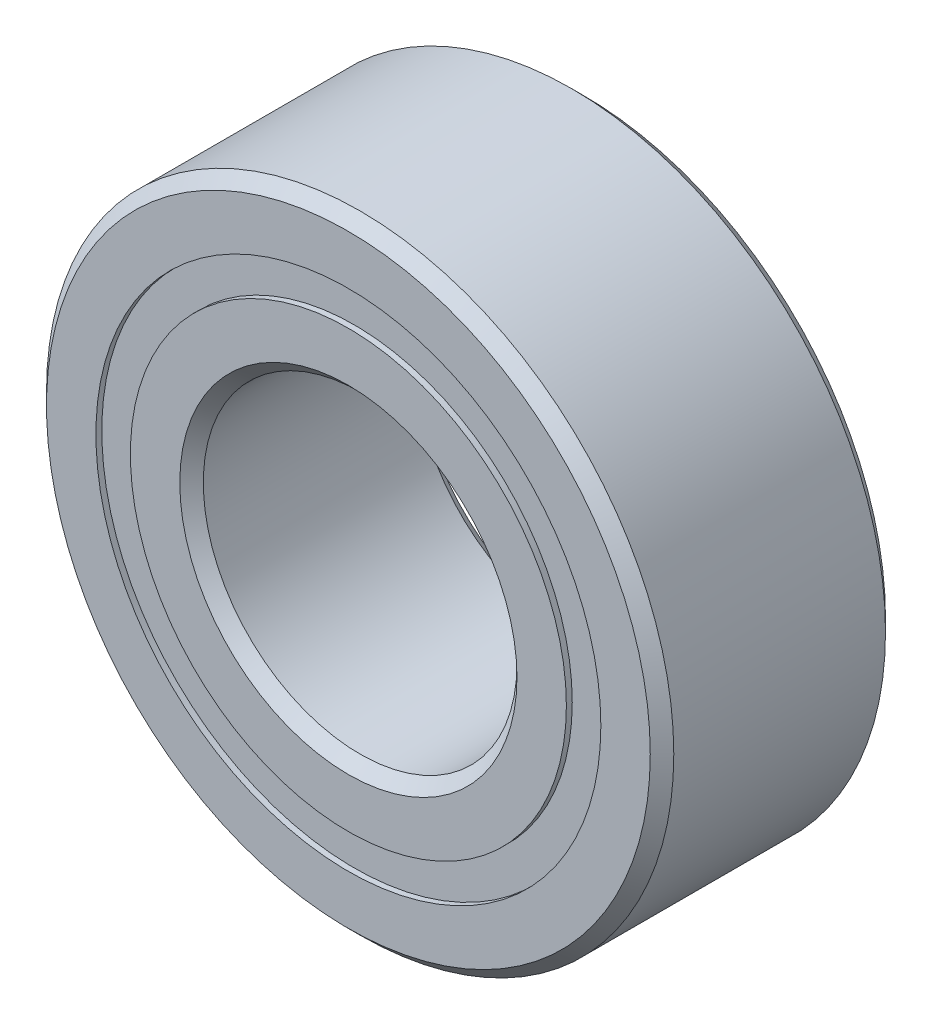
ISO-10303-21;
HEADER;
FILE_DESCRIPTION(('STEP AP214'),'2;1');
FILE_NAME('part.step','',(''),(''),'','','');
FILE_SCHEMA(('AUTOMOTIVE_DESIGN { 1 0 10303 214 1 1 1 1 }'));
ENDSEC;
DATA;
#1=APPLICATION_CONTEXT('core data for automotive mechanical design processes');
#2=APPLICATION_PROTOCOL_DEFINITION('international standard','automotive_design',2000,#1);
#3=PRODUCT_CONTEXT('',#1,'mechanical');
#4=PRODUCT('Part','Part','',(#3));
#5=PRODUCT_RELATED_PRODUCT_CATEGORY('part','',(#4));
#6=PRODUCT_DEFINITION_FORMATION('','',#4);
#7=PRODUCT_DEFINITION_CONTEXT('part definition',#1,'design');
#8=PRODUCT_DEFINITION('design','',#6,#7);
#9=PRODUCT_DEFINITION_SHAPE('','',#8);
#10=(LENGTH_UNIT() NAMED_UNIT(*) SI_UNIT(.MILLI.,.METRE.));
#11=(NAMED_UNIT(*) PLANE_ANGLE_UNIT() SI_UNIT($,.RADIAN.));
#12=(NAMED_UNIT(*) SI_UNIT($,.STERADIAN.) SOLID_ANGLE_UNIT());
#13=UNCERTAINTY_MEASURE_WITH_UNIT(LENGTH_MEASURE(1.E-05),#10,'distance_accuracy_value','');
#14=(GEOMETRIC_REPRESENTATION_CONTEXT(3) GLOBAL_UNCERTAINTY_ASSIGNED_CONTEXT((#13)) GLOBAL_UNIT_ASSIGNED_CONTEXT((#10,
#11,#12)) REPRESENTATION_CONTEXT('',''));
#15=CARTESIAN_POINT('',(0.,0.,0.));
#16=DIRECTION('',(0.,0.,1.));
#17=DIRECTION('',(1.,0.,0.));
#18=AXIS2_PLACEMENT_3D('',#15,#16,#17);
#19=CARTESIAN_POINT('',(0.,0.,2.38125));
#20=DIRECTION('',(0.,0.,-1.));
#21=DIRECTION('',(-1.,0.,0.));
#22=AXIS2_PLACEMENT_3D('',#19,#20,#21);
#23=CONICAL_SURFACE('',#22,6.111875,0.785398163397447);
#24=CARTESIAN_POINT('',(0.,0.,2.143125));
#25=DIRECTION('',(0.,0.,1.));
#26=DIRECTION('',(1.,0.,0.));
#27=AXIS2_PLACEMENT_3D('',#24,#25,#26);
#28=CIRCLE('',#27,6.35);
#29=CARTESIAN_POINT('',(6.35,0.,2.143125));
#30=VERTEX_POINT('',#29);
#31=EDGE_CURVE('E10',#30,#30,#28,.T.);
#32=ORIENTED_EDGE('',*,*,#31,.T.);
#33=EDGE_LOOP('',(#32));
#34=FACE_BOUND('',#33,.T.);
#35=CARTESIAN_POINT('',(0.,0.,2.38125));
#36=DIRECTION('',(0.,0.,1.));
#37=DIRECTION('',(1.,0.,0.));
#38=AXIS2_PLACEMENT_3D('',#35,#36,#37);
#39=CIRCLE('',#38,6.111875);
#40=CARTESIAN_POINT('',(6.111875,0.,2.38125));
#41=VERTEX_POINT('',#40);
#42=EDGE_CURVE('E110',#41,#41,#39,.T.);
#43=ORIENTED_EDGE('',*,*,#42,.F.);
#44=EDGE_LOOP('',(#43));
#45=FACE_BOUND('',#44,.T.);
#46=ADVANCED_FACE('F43',(#34,#45),#23,.T.);
#47=CARTESIAN_POINT('',(0.,0.,-2.38125));
#48=DIRECTION('',(0.,0.,1.));
#49=DIRECTION('',(1.,0.,0.));
#50=AXIS2_PLACEMENT_3D('',#47,#48,#49);
#51=CYLINDRICAL_SURFACE('',#50,6.35);
#52=CARTESIAN_POINT('',(0.,0.,-2.143125));
#53=DIRECTION('',(0.,0.,1.));
#54=DIRECTION('',(1.,0.,0.));
#55=AXIS2_PLACEMENT_3D('',#52,#53,#54);
#56=CIRCLE('',#55,6.35);
#57=CARTESIAN_POINT('',(6.35,0.,-2.143125));
#58=VERTEX_POINT('',#57);
#59=EDGE_CURVE('E50',#58,#58,#56,.T.);
#60=ORIENTED_EDGE('',*,*,#59,.T.);
#61=EDGE_LOOP('',(#60));
#62=FACE_BOUND('',#61,.T.);
#63=ORIENTED_EDGE('',*,*,#31,.F.);
#64=EDGE_LOOP('',(#63));
#65=FACE_BOUND('',#64,.T.);
#66=ADVANCED_FACE('F119',(#62,#65),#51,.T.);
#67=CARTESIAN_POINT('',(0.,0.,-2.143125));
#68=DIRECTION('',(0.,0.,1.));
#69=DIRECTION('',(1.,0.,0.));
#70=AXIS2_PLACEMENT_3D('',#67,#68,#69);
#71=CONICAL_SURFACE('',#70,6.35,0.785398163397446);
#72=CARTESIAN_POINT('',(0.,0.,-2.38125));
#73=DIRECTION('',(0.,0.,1.));
#74=DIRECTION('',(1.,0.,0.));
#75=AXIS2_PLACEMENT_3D('',#72,#73,#74);
#76=CIRCLE('',#75,6.111875);
#77=CARTESIAN_POINT('',(6.111875,0.,-2.38125));
#78=VERTEX_POINT('',#77);
#79=EDGE_CURVE('E55',#78,#78,#76,.T.);
#80=ORIENTED_EDGE('',*,*,#79,.T.);
#81=EDGE_LOOP('',(#80));
#82=FACE_BOUND('',#81,.T.);
#83=ORIENTED_EDGE('',*,*,#59,.F.);
#84=EDGE_LOOP('',(#83));
#85=FACE_BOUND('',#84,.T.);
#86=ADVANCED_FACE('F123',(#82,#85),#71,.T.);
#87=CARTESIAN_POINT('',(6.111875,0.,-2.38125));
#88=DIRECTION('',(0.,0.,-1.));
#89=DIRECTION('',(-1.,0.,0.));
#90=AXIS2_PLACEMENT_3D('',#87,#88,#89);
#91=PLANE('',#90);
#92=CARTESIAN_POINT('',(0.,0.,-2.38125));
#93=DIRECTION('',(0.,0.,1.));
#94=DIRECTION('',(1.,0.,0.));
#95=AXIS2_PLACEMENT_3D('',#92,#93,#94);
#96=CIRCLE('',#95,5.11140109890111);
#97=CARTESIAN_POINT('',(5.11140109890111,0.,-2.38125));
#98=VERTEX_POINT('',#97);
#99=EDGE_CURVE('E60',#98,#98,#96,.T.);
#100=ORIENTED_EDGE('',*,*,#99,.T.);
#101=EDGE_LOOP('',(#100));
#102=FACE_BOUND('',#101,.T.);
#103=ORIENTED_EDGE('',*,*,#79,.F.);
#104=EDGE_LOOP('',(#103));
#105=FACE_BOUND('',#104,.T.);
#106=ADVANCED_FACE('F127',(#102,#105),#91,.T.);
#107=CARTESIAN_POINT('',(0.,0.,-2.38125));
#108=DIRECTION('',(0.,0.,1.));
#109=DIRECTION('',(1.,0.,0.));
#110=AXIS2_PLACEMENT_3D('',#107,#108,#109);
#111=CYLINDRICAL_SURFACE('',#110,5.11140109890111);
#112=CARTESIAN_POINT('',(0.,0.,-2.2621875));
#113=DIRECTION('',(0.,0.,1.));
#114=DIRECTION('',(1.,0.,0.));
#115=AXIS2_PLACEMENT_3D('',#112,#113,#114);
#116=CIRCLE('',#115,5.11140109890111);
#117=CARTESIAN_POINT('',(5.11140109890111,0.,-2.2621875));
#118=VERTEX_POINT('',#117);
#119=EDGE_CURVE('E66',#118,#118,#116,.T.);
#120=ORIENTED_EDGE('',*,*,#119,.T.);
#121=EDGE_LOOP('',(#120));
#122=FACE_BOUND('',#121,.T.);
#123=ORIENTED_EDGE('',*,*,#99,.F.);
#124=EDGE_LOOP('',(#123));
#125=FACE_BOUND('',#124,.T.);
#126=ADVANCED_FACE('F134',(#122,#125),#111,.F.);
#127=CARTESIAN_POINT('',(5.11140109890111,0.,-2.2621875));
#128=DIRECTION('',(0.,0.,-1.));
#129=DIRECTION('',(-1.,0.,0.));
#130=AXIS2_PLACEMENT_3D('',#127,#128,#129);
#131=PLANE('',#130);
#132=CARTESIAN_POINT('',(0.,0.,-2.2621875));
#133=DIRECTION('',(0.,0.,1.));
#134=DIRECTION('',(1.,0.,0.));
#135=AXIS2_PLACEMENT_3D('',#132,#133,#134);
#136=CIRCLE('',#135,4.4135989010989);
#137=CARTESIAN_POINT('',(4.4135989010989,0.,-2.2621875));
#138=VERTEX_POINT('',#137);
#139=EDGE_CURVE('E70',#138,#138,#136,.T.);
#140=ORIENTED_EDGE('',*,*,#139,.T.);
#141=EDGE_LOOP('',(#140));
#142=FACE_BOUND('',#141,.T.);
#143=ORIENTED_EDGE('',*,*,#119,.F.);
#144=EDGE_LOOP('',(#143));
#145=FACE_BOUND('',#144,.T.);
#146=ADVANCED_FACE('F138',(#142,#145),#131,.T.);
#147=CARTESIAN_POINT('',(0.,0.,-2.38125));
#148=DIRECTION('',(0.,0.,1.));
#149=DIRECTION('',(1.,0.,0.));
#150=AXIS2_PLACEMENT_3D('',#147,#148,#149);
#151=CYLINDRICAL_SURFACE('',#150,4.4135989010989);
#152=CARTESIAN_POINT('',(0.,0.,-2.38125));
#153=DIRECTION('',(0.,0.,1.));
#154=DIRECTION('',(1.,0.,0.));
#155=AXIS2_PLACEMENT_3D('',#152,#153,#154);
#156=CIRCLE('',#155,4.4135989010989);
#157=CARTESIAN_POINT('',(4.4135989010989,0.,-2.38125));
#158=VERTEX_POINT('',#157);
#159=EDGE_CURVE('E74',#158,#158,#156,.T.);
#160=ORIENTED_EDGE('',*,*,#159,.T.);
#161=EDGE_LOOP('',(#160));
#162=FACE_BOUND('',#161,.T.);
#163=ORIENTED_EDGE('',*,*,#139,.F.);
#164=EDGE_LOOP('',(#163));
#165=FACE_BOUND('',#164,.T.);
#166=ADVANCED_FACE('F142',(#162,#165),#151,.T.);
#167=CARTESIAN_POINT('',(4.4135989010989,0.,-2.38125));
#168=DIRECTION('',(0.,0.,-1.));
#169=DIRECTION('',(-1.,0.,0.));
#170=AXIS2_PLACEMENT_3D('',#167,#168,#169);
#171=PLANE('',#170);
#172=CARTESIAN_POINT('',(0.,0.,-2.38125));
#173=DIRECTION('',(0.,0.,1.));
#174=DIRECTION('',(1.,0.,0.));
#175=AXIS2_PLACEMENT_3D('',#172,#173,#174);
#176=CIRCLE('',#175,3.413125);
#177=CARTESIAN_POINT('',(3.413125,0.,-2.38125));
#178=VERTEX_POINT('',#177);
#179=EDGE_CURVE('E78',#178,#178,#176,.T.);
#180=ORIENTED_EDGE('',*,*,#179,.T.);
#181=EDGE_LOOP('',(#180));
#182=FACE_BOUND('',#181,.T.);
#183=ORIENTED_EDGE('',*,*,#159,.F.);
#184=EDGE_LOOP('',(#183));
#185=FACE_BOUND('',#184,.T.);
#186=ADVANCED_FACE('F146',(#182,#185),#171,.T.);
#187=CARTESIAN_POINT('',(0.,0.,-2.38125));
#188=DIRECTION('',(0.,0.,-1.));
#189=DIRECTION('',(-1.,0.,0.));
#190=AXIS2_PLACEMENT_3D('',#187,#188,#189);
#191=CONICAL_SURFACE('',#190,3.413125,0.78539816339744);
#192=CARTESIAN_POINT('',(0.,0.,-2.143125));
#193=DIRECTION('',(0.,0.,1.));
#194=DIRECTION('',(1.,0.,0.));
#195=AXIS2_PLACEMENT_3D('',#192,#193,#194);
#196=CIRCLE('',#195,3.175);
#197=CARTESIAN_POINT('',(3.175,0.,-2.143125));
#198=VERTEX_POINT('',#197);
#199=EDGE_CURVE('E82',#198,#198,#196,.T.);
#200=ORIENTED_EDGE('',*,*,#199,.T.);
#201=EDGE_LOOP('',(#200));
#202=FACE_BOUND('',#201,.T.);
#203=ORIENTED_EDGE('',*,*,#179,.F.);
#204=EDGE_LOOP('',(#203));
#205=FACE_BOUND('',#204,.T.);
#206=ADVANCED_FACE('F150',(#202,#205),#191,.F.);
#207=CARTESIAN_POINT('',(0.,0.,-2.38125));
#208=DIRECTION('',(0.,0.,1.));
#209=DIRECTION('',(1.,0.,0.));
#210=AXIS2_PLACEMENT_3D('',#207,#208,#209);
#211=CYLINDRICAL_SURFACE('',#210,3.175);
#212=CARTESIAN_POINT('',(0.,0.,2.143125));
#213=DIRECTION('',(0.,0.,1.));
#214=DIRECTION('',(1.,0.,0.));
#215=AXIS2_PLACEMENT_3D('',#212,#213,#214);
#216=CIRCLE('',#215,3.175);
#217=CARTESIAN_POINT('',(3.175,0.,2.143125));
#218=VERTEX_POINT('',#217);
#219=EDGE_CURVE('E86',#218,#218,#216,.T.);
#220=ORIENTED_EDGE('',*,*,#219,.T.);
#221=EDGE_LOOP('',(#220));
#222=FACE_BOUND('',#221,.T.);
#223=ORIENTED_EDGE('',*,*,#199,.F.);
#224=EDGE_LOOP('',(#223));
#225=FACE_BOUND('',#224,.T.);
#226=ADVANCED_FACE('F154',(#222,#225),#211,.F.);
#227=CARTESIAN_POINT('',(0.,0.,2.143125));
#228=DIRECTION('',(0.,0.,1.));
#229=DIRECTION('',(1.,0.,0.));
#230=AXIS2_PLACEMENT_3D('',#227,#228,#229);
#231=CONICAL_SURFACE('',#230,3.175,0.785398163397441);
#232=CARTESIAN_POINT('',(0.,0.,2.38125));
#233=DIRECTION('',(0.,0.,1.));
#234=DIRECTION('',(1.,0.,0.));
#235=AXIS2_PLACEMENT_3D('',#232,#233,#234);
#236=CIRCLE('',#235,3.413125);
#237=CARTESIAN_POINT('',(3.413125,0.,2.38125));
#238=VERTEX_POINT('',#237);
#239=EDGE_CURVE('E90',#238,#238,#236,.T.);
#240=ORIENTED_EDGE('',*,*,#239,.T.);
#241=EDGE_LOOP('',(#240));
#242=FACE_BOUND('',#241,.T.);
#243=ORIENTED_EDGE('',*,*,#219,.F.);
#244=EDGE_LOOP('',(#243));
#245=FACE_BOUND('',#244,.T.);
#246=ADVANCED_FACE('F158',(#242,#245),#231,.F.);
#247=CARTESIAN_POINT('',(3.413125,0.,2.38125));
#248=DIRECTION('',(0.,0.,1.));
#249=DIRECTION('',(1.,0.,0.));
#250=AXIS2_PLACEMENT_3D('',#247,#248,#249);
#251=PLANE('',#250);
#252=CARTESIAN_POINT('',(0.,0.,2.38125));
#253=DIRECTION('',(0.,0.,1.));
#254=DIRECTION('',(1.,0.,0.));
#255=AXIS2_PLACEMENT_3D('',#252,#253,#254);
#256=CIRCLE('',#255,4.4135989010989);
#257=CARTESIAN_POINT('',(4.4135989010989,0.,2.38125));
#258=VERTEX_POINT('',#257);
#259=EDGE_CURVE('E94',#258,#258,#256,.T.);
#260=ORIENTED_EDGE('',*,*,#259,.T.);
#261=EDGE_LOOP('',(#260));
#262=FACE_BOUND('',#261,.T.);
#263=ORIENTED_EDGE('',*,*,#239,.F.);
#264=EDGE_LOOP('',(#263));
#265=FACE_BOUND('',#264,.T.);
#266=ADVANCED_FACE('F162',(#262,#265),#251,.T.);
#267=CARTESIAN_POINT('',(0.,0.,-2.38125));
#268=DIRECTION('',(0.,0.,1.));
#269=DIRECTION('',(1.,0.,0.));
#270=AXIS2_PLACEMENT_3D('',#267,#268,#269);
#271=CYLINDRICAL_SURFACE('',#270,4.4135989010989);
#272=CARTESIAN_POINT('',(0.,0.,2.2621875));
#273=DIRECTION('',(0.,0.,1.));
#274=DIRECTION('',(1.,0.,0.));
#275=AXIS2_PLACEMENT_3D('',#272,#273,#274);
#276=CIRCLE('',#275,4.4135989010989);
#277=CARTESIAN_POINT('',(4.4135989010989,0.,2.2621875));
#278=VERTEX_POINT('',#277);
#279=EDGE_CURVE('E98',#278,#278,#276,.T.);
#280=ORIENTED_EDGE('',*,*,#279,.T.);
#281=EDGE_LOOP('',(#280));
#282=FACE_BOUND('',#281,.T.);
#283=ORIENTED_EDGE('',*,*,#259,.F.);
#284=EDGE_LOOP('',(#283));
#285=FACE_BOUND('',#284,.T.);
#286=ADVANCED_FACE('F166',(#282,#285),#271,.T.);
#287=CARTESIAN_POINT('',(4.4135989010989,0.,2.2621875));
#288=DIRECTION('',(0.,0.,1.));
#289=DIRECTION('',(1.,0.,0.));
#290=AXIS2_PLACEMENT_3D('',#287,#288,#289);
#291=PLANE('',#290);
#292=CARTESIAN_POINT('',(0.,0.,2.2621875));
#293=DIRECTION('',(0.,0.,1.));
#294=DIRECTION('',(1.,0.,0.));
#295=AXIS2_PLACEMENT_3D('',#292,#293,#294);
#296=CIRCLE('',#295,5.11140109890111);
#297=CARTESIAN_POINT('',(5.11140109890111,0.,2.2621875));
#298=VERTEX_POINT('',#297);
#299=EDGE_CURVE('E102',#298,#298,#296,.T.);
#300=ORIENTED_EDGE('',*,*,#299,.T.);
#301=EDGE_LOOP('',(#300));
#302=FACE_BOUND('',#301,.T.);
#303=ORIENTED_EDGE('',*,*,#279,.F.);
#304=EDGE_LOOP('',(#303));
#305=FACE_BOUND('',#304,.T.);
#306=ADVANCED_FACE('F170',(#302,#305),#291,.T.);
#307=CARTESIAN_POINT('',(0.,0.,-2.38125));
#308=DIRECTION('',(0.,0.,1.));
#309=DIRECTION('',(1.,0.,0.));
#310=AXIS2_PLACEMENT_3D('',#307,#308,#309);
#311=CYLINDRICAL_SURFACE('',#310,5.11140109890111);
#312=CARTESIAN_POINT('',(0.,0.,2.38125));
#313=DIRECTION('',(0.,0.,1.));
#314=DIRECTION('',(1.,0.,0.));
#315=AXIS2_PLACEMENT_3D('',#312,#313,#314);
#316=CIRCLE('',#315,5.11140109890111);
#317=CARTESIAN_POINT('',(5.11140109890111,0.,2.38125));
#318=VERTEX_POINT('',#317);
#319=EDGE_CURVE('E106',#318,#318,#316,.T.);
#320=ORIENTED_EDGE('',*,*,#319,.T.);
#321=EDGE_LOOP('',(#320));
#322=FACE_BOUND('',#321,.T.);
#323=ORIENTED_EDGE('',*,*,#299,.F.);
#324=EDGE_LOOP('',(#323));
#325=FACE_BOUND('',#324,.T.);
#326=ADVANCED_FACE('F174',(#322,#325),#311,.F.);
#327=CARTESIAN_POINT('',(5.11140109890111,0.,2.38125));
#328=DIRECTION('',(0.,0.,1.));
#329=DIRECTION('',(1.,0.,0.));
#330=AXIS2_PLACEMENT_3D('',#327,#328,#329);
#331=PLANE('',#330);
#332=ORIENTED_EDGE('',*,*,#42,.T.);
#333=EDGE_LOOP('',(#332));
#334=FACE_BOUND('',#333,.T.);
#335=ORIENTED_EDGE('',*,*,#319,.F.);
#336=EDGE_LOOP('',(#335));
#337=FACE_BOUND('',#336,.T.);
#338=ADVANCED_FACE('F115',(#334,#337),#331,.T.);
#339=CLOSED_SHELL('',(#46,#66,#86,#106,#126,#146,#166,#186,#206,#226,#246,#266,#286,#306,#326,#338));
#340=MANIFOLD_SOLID_BREP('B2',#339);
#341=ADVANCED_BREP_SHAPE_REPRESENTATION('',(#18,#340),#14);
#342=SHAPE_DEFINITION_REPRESENTATION(#9,#341);
ENDSEC;
END-ISO-10303-21;
